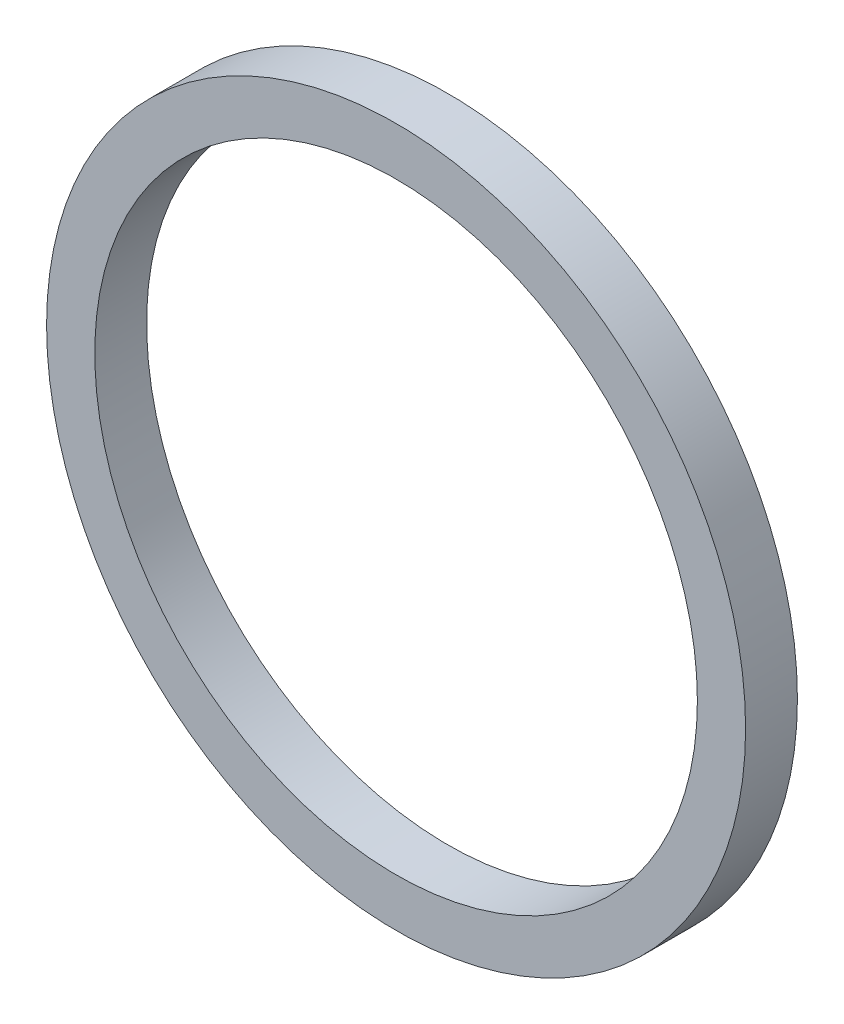
ISO-10303-21;
HEADER;
FILE_DESCRIPTION(('STEP AP214'),'2;1');
FILE_NAME('part.step','',(''),(''),'','','');
FILE_SCHEMA(('AUTOMOTIVE_DESIGN { 1 0 10303 214 1 1 1 1 }'));
ENDSEC;
DATA;
#1=APPLICATION_CONTEXT('core data for automotive mechanical design processes');
#2=APPLICATION_PROTOCOL_DEFINITION('international standard','automotive_design',2000,#1);
#3=PRODUCT_CONTEXT('',#1,'mechanical');
#4=PRODUCT('Part','Part','',(#3));
#5=PRODUCT_RELATED_PRODUCT_CATEGORY('part','',(#4));
#6=PRODUCT_DEFINITION_FORMATION('','',#4);
#7=PRODUCT_DEFINITION_CONTEXT('part definition',#1,'design');
#8=PRODUCT_DEFINITION('design','',#6,#7);
#9=PRODUCT_DEFINITION_SHAPE('','',#8);
#10=(LENGTH_UNIT() NAMED_UNIT(*) SI_UNIT(.MILLI.,.METRE.));
#11=(NAMED_UNIT(*) PLANE_ANGLE_UNIT() SI_UNIT($,.RADIAN.));
#12=(NAMED_UNIT(*) SI_UNIT($,.STERADIAN.) SOLID_ANGLE_UNIT());
#13=UNCERTAINTY_MEASURE_WITH_UNIT(LENGTH_MEASURE(1.E-05),#10,'distance_accuracy_value','');
#14=(GEOMETRIC_REPRESENTATION_CONTEXT(3) GLOBAL_UNCERTAINTY_ASSIGNED_CONTEXT((#13)) GLOBAL_UNIT_ASSIGNED_CONTEXT((#10,
#11,#12)) REPRESENTATION_CONTEXT('',''));
#15=CARTESIAN_POINT('',(0.,0.,0.));
#16=DIRECTION('',(0.,0.,1.));
#17=DIRECTION('',(1.,0.,0.));
#18=AXIS2_PLACEMENT_3D('',#15,#16,#17);
#19=CARTESIAN_POINT('',(0.,0.,12.9));
#20=DIRECTION('',(0.,0.,1.));
#21=DIRECTION('',(1.,0.,0.));
#22=AXIS2_PLACEMENT_3D('',#19,#20,#21);
#23=PLANE('',#22);
#24=CARTESIAN_POINT('',(0.,0.,12.9));
#25=DIRECTION('',(0.,0.,1.));
#26=DIRECTION('',(1.,0.,0.));
#27=AXIS2_PLACEMENT_3D('',#24,#25,#26);
#28=CIRCLE('',#27,87.);
#29=CARTESIAN_POINT('',(87.,0.,12.9));
#30=VERTEX_POINT('',#29);
#31=EDGE_CURVE('E10',#30,#30,#28,.T.);
#32=ORIENTED_EDGE('',*,*,#31,.T.);
#33=EDGE_LOOP('',(#32));
#34=FACE_BOUND('',#33,.T.);
#35=CARTESIAN_POINT('',(0.,0.,12.9));
#36=DIRECTION('',(0.,0.,1.));
#37=DIRECTION('',(1.,0.,0.));
#38=AXIS2_PLACEMENT_3D('',#35,#36,#37);
#39=CIRCLE('',#38,75.);
#40=CARTESIAN_POINT('',(75.,0.,12.9));
#41=VERTEX_POINT('',#40);
#42=EDGE_CURVE('E43',#41,#41,#39,.T.);
#43=ORIENTED_EDGE('',*,*,#42,.F.);
#44=EDGE_LOOP('',(#43));
#45=FACE_BOUND('',#44,.T.);
#46=ADVANCED_FACE('F32',(#34,#45),#23,.T.);
#47=CARTESIAN_POINT('',(0.,0.,0.));
#48=DIRECTION('',(0.,0.,1.));
#49=DIRECTION('',(1.,0.,0.));
#50=AXIS2_PLACEMENT_3D('',#47,#48,#49);
#51=PLANE('',#50);
#52=CARTESIAN_POINT('',(0.,0.,0.));
#53=DIRECTION('',(0.,0.,1.));
#54=DIRECTION('',(1.,0.,0.));
#55=AXIS2_PLACEMENT_3D('',#52,#53,#54);
#56=CIRCLE('',#55,87.);
#57=CARTESIAN_POINT('',(87.,0.,0.));
#58=VERTEX_POINT('',#57);
#59=EDGE_CURVE('E36',#58,#58,#56,.T.);
#60=ORIENTED_EDGE('',*,*,#59,.F.);
#61=EDGE_LOOP('',(#60));
#62=FACE_BOUND('',#61,.T.);
#63=CARTESIAN_POINT('',(0.,0.,0.));
#64=DIRECTION('',(0.,0.,1.));
#65=DIRECTION('',(1.,0.,0.));
#66=AXIS2_PLACEMENT_3D('',#63,#64,#65);
#67=CIRCLE('',#66,75.);
#68=CARTESIAN_POINT('',(75.,0.,0.));
#69=VERTEX_POINT('',#68);
#70=EDGE_CURVE('E45',#69,#69,#67,.T.);
#71=ORIENTED_EDGE('',*,*,#70,.T.);
#72=EDGE_LOOP('',(#71));
#73=FACE_BOUND('',#72,.T.);
#74=ADVANCED_FACE('F55',(#62,#73),#51,.F.);
#75=CARTESIAN_POINT('',(0.,0.,12.9));
#76=DIRECTION('',(0.,0.,-1.));
#77=DIRECTION('',(-1.,0.,0.));
#78=AXIS2_PLACEMENT_3D('',#75,#76,#77);
#79=CYLINDRICAL_SURFACE('',#78,87.);
#80=ORIENTED_EDGE('',*,*,#31,.F.);
#81=EDGE_LOOP('',(#80));
#82=FACE_BOUND('',#81,.T.);
#83=ORIENTED_EDGE('',*,*,#59,.T.);
#84=EDGE_LOOP('',(#83));
#85=FACE_BOUND('',#84,.T.);
#86=ADVANCED_FACE('F34',(#82,#85),#79,.T.);
#87=CARTESIAN_POINT('',(0.,0.,12.9));
#88=DIRECTION('',(0.,0.,-1.));
#89=DIRECTION('',(-1.,0.,0.));
#90=AXIS2_PLACEMENT_3D('',#87,#88,#89);
#91=CYLINDRICAL_SURFACE('',#90,75.);
#92=ORIENTED_EDGE('',*,*,#42,.T.);
#93=EDGE_LOOP('',(#92));
#94=FACE_BOUND('',#93,.T.);
#95=ORIENTED_EDGE('',*,*,#70,.F.);
#96=EDGE_LOOP('',(#95));
#97=FACE_BOUND('',#96,.T.);
#98=ADVANCED_FACE('F51',(#94,#97),#91,.F.);
#99=CLOSED_SHELL('',(#46,#74,#86,#98));
#100=MANIFOLD_SOLID_BREP('B2',#99);
#101=ADVANCED_BREP_SHAPE_REPRESENTATION('',(#18,#100),#14);
#102=SHAPE_DEFINITION_REPRESENTATION(#9,#101);
ENDSEC;
END-ISO-10303-21;
